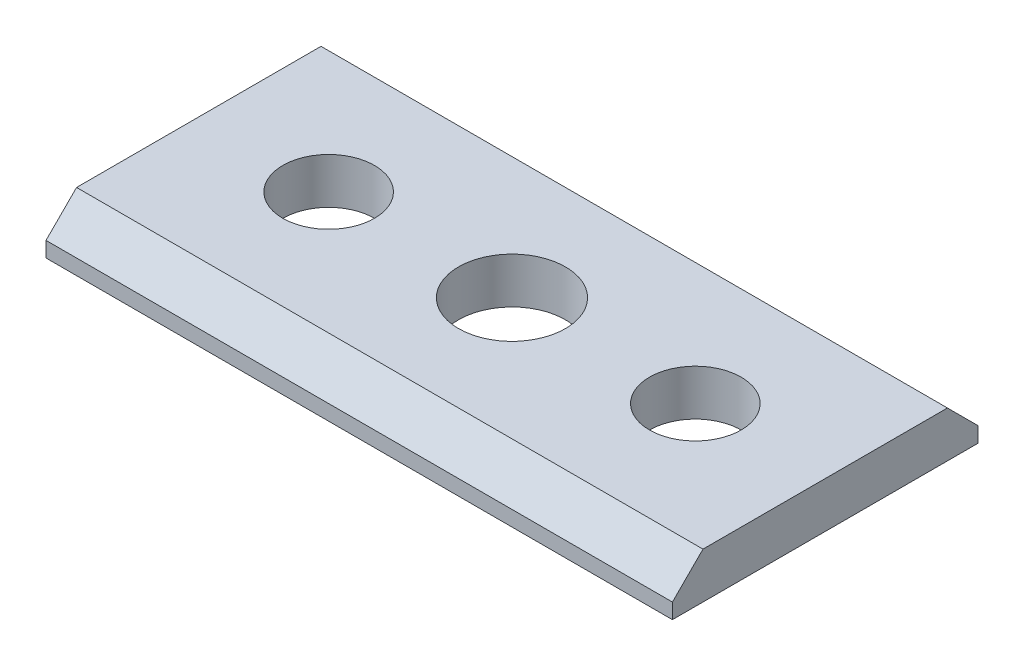
ISO-10303-21;
HEADER;
FILE_DESCRIPTION(('STEP AP214'),'2;1');
FILE_NAME('part.step','',(''),(''),'','','');
FILE_SCHEMA(('AUTOMOTIVE_DESIGN { 1 0 10303 214 1 1 1 1 }'));
ENDSEC;
DATA;
#1=APPLICATION_CONTEXT('core data for automotive mechanical design processes');
#2=APPLICATION_PROTOCOL_DEFINITION('international standard','automotive_design',2000,#1);
#3=PRODUCT_CONTEXT('',#1,'mechanical');
#4=PRODUCT('Part','Part','',(#3));
#5=PRODUCT_RELATED_PRODUCT_CATEGORY('part','',(#4));
#6=PRODUCT_DEFINITION_FORMATION('','',#4);
#7=PRODUCT_DEFINITION_CONTEXT('part definition',#1,'design');
#8=PRODUCT_DEFINITION('design','',#6,#7);
#9=PRODUCT_DEFINITION_SHAPE('','',#8);
#10=(LENGTH_UNIT() NAMED_UNIT(*) SI_UNIT(.MILLI.,.METRE.));
#11=(NAMED_UNIT(*) PLANE_ANGLE_UNIT() SI_UNIT($,.RADIAN.));
#12=(NAMED_UNIT(*) SI_UNIT($,.STERADIAN.) SOLID_ANGLE_UNIT());
#13=UNCERTAINTY_MEASURE_WITH_UNIT(LENGTH_MEASURE(1.E-05),#10,'distance_accuracy_value','');
#14=(GEOMETRIC_REPRESENTATION_CONTEXT(3) GLOBAL_UNCERTAINTY_ASSIGNED_CONTEXT((#13)) GLOBAL_UNIT_ASSIGNED_CONTEXT((#10,
#11,#12)) REPRESENTATION_CONTEXT('',''));
#15=CARTESIAN_POINT('',(0.,0.,0.));
#16=DIRECTION('',(0.,0.,1.));
#17=DIRECTION('',(1.,0.,0.));
#18=AXIS2_PLACEMENT_3D('',#15,#16,#17);
#19=CARTESIAN_POINT('',(41.,-3.,-20.));
#20=DIRECTION('',(0.,0.,-1.));
#21=DIRECTION('',(-1.,0.,0.));
#22=AXIS2_PLACEMENT_3D('',#19,#20,#21);
#23=PLANE('',#22);
#24=DIRECTION('',(0.,1.,0.));
#25=VECTOR('',#24,1.);
#26=CARTESIAN_POINT('',(0.,-3.,-20.));
#27=LINE('',#26,#25);
#28=CARTESIAN_POINT('',(0.,-3.,-20.));
#29=VERTEX_POINT('',#28);
#30=CARTESIAN_POINT('',(0.,-2.00000000000001,-20.));
#31=VERTEX_POINT('',#30);
#32=EDGE_CURVE('E84',#29,#31,#27,.T.);
#33=ORIENTED_EDGE('',*,*,#32,.T.);
#34=DIRECTION('',(1.,0.,0.));
#35=VECTOR('',#34,1.);
#36=CARTESIAN_POINT('',(41.,-2.00000000000001,-20.));
#37=LINE('',#36,#35);
#38=CARTESIAN_POINT('',(41.,-2.00000000000001,-20.));
#39=VERTEX_POINT('',#38);
#40=EDGE_CURVE('E55',#31,#39,#37,.T.);
#41=ORIENTED_EDGE('',*,*,#40,.T.);
#42=DIRECTION('',(0.,1.,0.));
#43=VECTOR('',#42,1.);
#44=CARTESIAN_POINT('',(41.,-3.,-20.));
#45=LINE('',#44,#43);
#46=CARTESIAN_POINT('',(41.,-3.,-20.));
#47=VERTEX_POINT('',#46);
#48=EDGE_CURVE('E105',#47,#39,#45,.T.);
#49=ORIENTED_EDGE('',*,*,#48,.F.);
#50=DIRECTION('',(-1.,0.,0.));
#51=VECTOR('',#50,1.);
#52=CARTESIAN_POINT('',(41.,-3.,-20.));
#53=LINE('',#52,#51);
#54=EDGE_CURVE('E100',#47,#29,#53,.T.);
#55=ORIENTED_EDGE('',*,*,#54,.T.);
#56=EDGE_LOOP('',(#33,#41,#49,#55));
#57=FACE_BOUND('',#56,.T.);
#58=ADVANCED_FACE('F32',(#57),#23,.T.);
#59=CARTESIAN_POINT('',(41.,-3.,0.));
#60=DIRECTION('',(1.,0.,0.));
#61=DIRECTION('',(0.,0.,-1.));
#62=AXIS2_PLACEMENT_3D('',#59,#60,#61);
#63=PLANE('',#62);
#64=ORIENTED_EDGE('',*,*,#48,.T.);
#65=DIRECTION('',(0.,-0.707106781186549,-0.707106781186546));
#66=VECTOR('',#65,1.);
#67=CARTESIAN_POINT('',(41.,7.5,-10.5));
#68=LINE('',#67,#66);
#69=CARTESIAN_POINT('',(41.,0.,-18.));
#70=VERTEX_POINT('',#69);
#71=EDGE_CURVE('E40',#39,#70,#68,.F.);
#72=ORIENTED_EDGE('',*,*,#71,.T.);
#73=DIRECTION('',(0.,0.,-1.));
#74=VECTOR('',#73,1.);
#75=CARTESIAN_POINT('',(41.,0.,0.));
#76=LINE('',#75,#74);
#77=CARTESIAN_POINT('',(41.,0.,-2.));
#78=VERTEX_POINT('',#77);
#79=EDGE_CURVE('E106',#78,#70,#76,.T.);
#80=ORIENTED_EDGE('',*,*,#79,.F.);
#81=DIRECTION('',(0.,0.707106781186549,-0.707106781186546));
#82=VECTOR('',#81,1.);
#83=CARTESIAN_POINT('',(41.,-2.50000000000001,0.499999999999996));
#84=LINE('',#83,#82);
#85=CARTESIAN_POINT('',(41.,-2.00000000000001,0.));
#86=VERTEX_POINT('',#85);
#87=EDGE_CURVE('E47',#78,#86,#84,.F.);
#88=ORIENTED_EDGE('',*,*,#87,.T.);
#89=DIRECTION('',(0.,1.,0.));
#90=VECTOR('',#89,1.);
#91=CARTESIAN_POINT('',(41.,-3.,0.));
#92=LINE('',#91,#90);
#93=CARTESIAN_POINT('',(41.,-3.,0.));
#94=VERTEX_POINT('',#93);
#95=EDGE_CURVE('E122',#94,#86,#92,.T.);
#96=ORIENTED_EDGE('',*,*,#95,.F.);
#97=DIRECTION('',(0.,0.,-1.));
#98=VECTOR('',#97,1.);
#99=CARTESIAN_POINT('',(41.,-3.,0.));
#100=LINE('',#99,#98);
#101=EDGE_CURVE('E93',#94,#47,#100,.T.);
#102=ORIENTED_EDGE('',*,*,#101,.T.);
#103=EDGE_LOOP('',(#64,#72,#80,#88,#96,#102));
#104=FACE_BOUND('',#103,.T.);
#105=ADVANCED_FACE('F135',(#104),#63,.T.);
#106=CARTESIAN_POINT('',(0.,-3.,0.));
#107=DIRECTION('',(0.,0.,1.));
#108=DIRECTION('',(1.,0.,0.));
#109=AXIS2_PLACEMENT_3D('',#106,#107,#108);
#110=PLANE('',#109);
#111=ORIENTED_EDGE('',*,*,#95,.T.);
#112=DIRECTION('',(-1.,0.,0.));
#113=VECTOR('',#112,1.);
#114=CARTESIAN_POINT('',(0.,-2.00000000000001,0.));
#115=LINE('',#114,#113);
#116=CARTESIAN_POINT('',(0.,-2.00000000000001,0.));
#117=VERTEX_POINT('',#116);
#118=EDGE_CURVE('E11',#86,#117,#115,.T.);
#119=ORIENTED_EDGE('',*,*,#118,.T.);
#120=DIRECTION('',(0.,1.,0.));
#121=VECTOR('',#120,1.);
#122=CARTESIAN_POINT('',(0.,-3.,0.));
#123=LINE('',#122,#121);
#124=CARTESIAN_POINT('',(0.,-3.,0.));
#125=VERTEX_POINT('',#124);
#126=EDGE_CURVE('E92',#125,#117,#123,.T.);
#127=ORIENTED_EDGE('',*,*,#126,.F.);
#128=DIRECTION('',(1.,0.,0.));
#129=VECTOR('',#128,1.);
#130=CARTESIAN_POINT('',(0.,-3.,0.));
#131=LINE('',#130,#129);
#132=EDGE_CURVE('E103',#125,#94,#131,.T.);
#133=ORIENTED_EDGE('',*,*,#132,.T.);
#134=EDGE_LOOP('',(#111,#119,#127,#133));
#135=FACE_BOUND('',#134,.T.);
#136=ADVANCED_FACE('F157',(#135),#110,.T.);
#137=CARTESIAN_POINT('',(0.,-3.,-20.));
#138=DIRECTION('',(-1.,0.,0.));
#139=DIRECTION('',(0.,0.,1.));
#140=AXIS2_PLACEMENT_3D('',#137,#138,#139);
#141=PLANE('',#140);
#142=DIRECTION('',(0.,0.,1.));
#143=VECTOR('',#142,1.);
#144=CARTESIAN_POINT('',(0.,0.,-20.));
#145=LINE('',#144,#143);
#146=CARTESIAN_POINT('',(0.,0.,-18.));
#147=VERTEX_POINT('',#146);
#148=CARTESIAN_POINT('',(0.,0.,-2.));
#149=VERTEX_POINT('',#148);
#150=EDGE_CURVE('E109',#147,#149,#145,.T.);
#151=ORIENTED_EDGE('',*,*,#150,.F.);
#152=DIRECTION('',(0.,0.707106781186549,0.707106781186546));
#153=VECTOR('',#152,1.);
#154=CARTESIAN_POINT('',(0.,-2.50000000000001,-20.5));
#155=LINE('',#154,#153);
#156=EDGE_CURVE('E90',#147,#31,#155,.F.);
#157=ORIENTED_EDGE('',*,*,#156,.T.);
#158=ORIENTED_EDGE('',*,*,#32,.F.);
#159=DIRECTION('',(0.,0.,1.));
#160=VECTOR('',#159,1.);
#161=CARTESIAN_POINT('',(0.,-3.,-20.));
#162=LINE('',#161,#160);
#163=EDGE_CURVE('E89',#29,#125,#162,.T.);
#164=ORIENTED_EDGE('',*,*,#163,.T.);
#165=ORIENTED_EDGE('',*,*,#126,.T.);
#166=DIRECTION('',(0.,-0.707106781186549,0.707106781186546));
#167=VECTOR('',#166,1.);
#168=CARTESIAN_POINT('',(0.,7.49999999999999,-9.49999999999996));
#169=LINE('',#168,#167);
#170=EDGE_CURVE('E130',#117,#149,#169,.F.);
#171=ORIENTED_EDGE('',*,*,#170,.T.);
#172=EDGE_LOOP('',(#151,#157,#158,#164,#165,#171));
#173=FACE_BOUND('',#172,.T.);
#174=ADVANCED_FACE('F87',(#173),#141,.T.);
#175=CARTESIAN_POINT('',(0.,-3.,0.));
#176=DIRECTION('',(0.,1.,0.));
#177=DIRECTION('',(0.,0.,1.));
#178=AXIS2_PLACEMENT_3D('',#175,#176,#177);
#179=PLANE('',#178);
#180=CARTESIAN_POINT('',(20.5,-3.,-10.));
#181=DIRECTION('',(0.,1.,0.));
#182=DIRECTION('',(0.,0.,1.));
#183=AXIS2_PLACEMENT_3D('',#180,#181,#182);
#184=CIRCLE('',#183,3.5);
#185=CARTESIAN_POINT('',(20.5,-3.,-6.5));
#186=VERTEX_POINT('',#185);
#187=EDGE_CURVE('E187',#186,#186,#184,.T.);
#188=ORIENTED_EDGE('',*,*,#187,.T.);
#189=EDGE_LOOP('',(#188));
#190=FACE_BOUND('',#189,.T.);
#191=CARTESIAN_POINT('',(32.5,-3.,-10.));
#192=DIRECTION('',(0.,1.,0.));
#193=DIRECTION('',(0.,0.,1.));
#194=AXIS2_PLACEMENT_3D('',#191,#192,#193);
#195=CIRCLE('',#194,3.);
#196=CARTESIAN_POINT('',(32.5,-3.,-7.));
#197=VERTEX_POINT('',#196);
#198=EDGE_CURVE('E182',#197,#197,#195,.T.);
#199=ORIENTED_EDGE('',*,*,#198,.T.);
#200=EDGE_LOOP('',(#199));
#201=FACE_BOUND('',#200,.T.);
#202=CARTESIAN_POINT('',(8.50000000000001,-3.,-10.));
#203=DIRECTION('',(0.,1.,0.));
#204=DIRECTION('',(0.,0.,1.));
#205=AXIS2_PLACEMENT_3D('',#202,#203,#204);
#206=CIRCLE('',#205,3.);
#207=CARTESIAN_POINT('',(8.50000000000001,-3.,-7.));
#208=VERTEX_POINT('',#207);
#209=EDGE_CURVE('E118',#208,#208,#206,.T.);
#210=ORIENTED_EDGE('',*,*,#209,.T.);
#211=EDGE_LOOP('',(#210));
#212=FACE_BOUND('',#211,.T.);
#213=ORIENTED_EDGE('',*,*,#54,.F.);
#214=ORIENTED_EDGE('',*,*,#101,.F.);
#215=ORIENTED_EDGE('',*,*,#132,.F.);
#216=ORIENTED_EDGE('',*,*,#163,.F.);
#217=EDGE_LOOP('',(#213,#214,#215,#216));
#218=FACE_BOUND('',#217,.T.);
#219=ADVANCED_FACE('F98',(#190,#201,#212,#218),#179,.F.);
#220=CARTESIAN_POINT('',(0.,0.,0.));
#221=DIRECTION('',(0.,1.,0.));
#222=DIRECTION('',(0.,0.,1.));
#223=AXIS2_PLACEMENT_3D('',#220,#221,#222);
#224=PLANE('',#223);
#225=CARTESIAN_POINT('',(20.5,0.,-10.));
#226=DIRECTION('',(0.,1.,0.));
#227=DIRECTION('',(0.,0.,1.));
#228=AXIS2_PLACEMENT_3D('',#225,#226,#227);
#229=CIRCLE('',#228,3.5);
#230=CARTESIAN_POINT('',(20.5,0.,-6.5));
#231=VERTEX_POINT('',#230);
#232=EDGE_CURVE('E191',#231,#231,#229,.T.);
#233=ORIENTED_EDGE('',*,*,#232,.F.);
#234=EDGE_LOOP('',(#233));
#235=FACE_BOUND('',#234,.T.);
#236=CARTESIAN_POINT('',(32.5,0.,-10.));
#237=DIRECTION('',(0.,1.,0.));
#238=DIRECTION('',(0.,0.,1.));
#239=AXIS2_PLACEMENT_3D('',#236,#237,#238);
#240=CIRCLE('',#239,3.);
#241=CARTESIAN_POINT('',(32.5,0.,-7.));
#242=VERTEX_POINT('',#241);
#243=EDGE_CURVE('E185',#242,#242,#240,.T.);
#244=ORIENTED_EDGE('',*,*,#243,.F.);
#245=EDGE_LOOP('',(#244));
#246=FACE_BOUND('',#245,.T.);
#247=CARTESIAN_POINT('',(8.50000000000001,0.,-10.));
#248=DIRECTION('',(0.,1.,0.));
#249=DIRECTION('',(0.,0.,1.));
#250=AXIS2_PLACEMENT_3D('',#247,#248,#249);
#251=CIRCLE('',#250,3.);
#252=CARTESIAN_POINT('',(8.50000000000001,0.,-7.));
#253=VERTEX_POINT('',#252);
#254=EDGE_CURVE('E112',#253,#253,#251,.T.);
#255=ORIENTED_EDGE('',*,*,#254,.F.);
#256=EDGE_LOOP('',(#255));
#257=FACE_BOUND('',#256,.T.);
#258=ORIENTED_EDGE('',*,*,#79,.T.);
#259=DIRECTION('',(-1.,0.,0.));
#260=VECTOR('',#259,1.);
#261=CARTESIAN_POINT('',(0.,0.,-18.));
#262=LINE('',#261,#260);
#263=EDGE_CURVE('E127',#70,#147,#262,.T.);
#264=ORIENTED_EDGE('',*,*,#263,.T.);
#265=ORIENTED_EDGE('',*,*,#150,.T.);
#266=DIRECTION('',(1.,0.,0.));
#267=VECTOR('',#266,1.);
#268=CARTESIAN_POINT('',(0.,0.,-2.));
#269=LINE('',#268,#267);
#270=EDGE_CURVE('E121',#149,#78,#269,.T.);
#271=ORIENTED_EDGE('',*,*,#270,.T.);
#272=EDGE_LOOP('',(#258,#264,#265,#271));
#273=FACE_BOUND('',#272,.T.);
#274=ADVANCED_FACE('F139',(#235,#246,#257,#273),#224,.T.);
#275=CARTESIAN_POINT('',(8.50000000000001,-3.,-10.));
#276=DIRECTION('',(0.,1.,0.));
#277=DIRECTION('',(0.,0.,1.));
#278=AXIS2_PLACEMENT_3D('',#275,#276,#277);
#279=CYLINDRICAL_SURFACE('',#278,3.);
#280=ORIENTED_EDGE('',*,*,#209,.F.);
#281=EDGE_LOOP('',(#280));
#282=FACE_BOUND('',#281,.T.);
#283=ORIENTED_EDGE('',*,*,#254,.T.);
#284=EDGE_LOOP('',(#283));
#285=FACE_BOUND('',#284,.T.);
#286=ADVANCED_FACE('F167',(#282,#285),#279,.F.);
#287=CARTESIAN_POINT('',(32.5,-3.,-10.));
#288=DIRECTION('',(0.,1.,0.));
#289=DIRECTION('',(0.,0.,1.));
#290=AXIS2_PLACEMENT_3D('',#287,#288,#289);
#291=CYLINDRICAL_SURFACE('',#290,3.);
#292=ORIENTED_EDGE('',*,*,#198,.F.);
#293=EDGE_LOOP('',(#292));
#294=FACE_BOUND('',#293,.T.);
#295=ORIENTED_EDGE('',*,*,#243,.T.);
#296=EDGE_LOOP('',(#295));
#297=FACE_BOUND('',#296,.T.);
#298=ADVANCED_FACE('F149',(#294,#297),#291,.F.);
#299=CARTESIAN_POINT('',(20.5,-3.,-10.));
#300=DIRECTION('',(0.,1.,0.));
#301=DIRECTION('',(0.,0.,1.));
#302=AXIS2_PLACEMENT_3D('',#299,#300,#301);
#303=CYLINDRICAL_SURFACE('',#302,3.5);
#304=ORIENTED_EDGE('',*,*,#187,.F.);
#305=EDGE_LOOP('',(#304));
#306=FACE_BOUND('',#305,.T.);
#307=ORIENTED_EDGE('',*,*,#232,.T.);
#308=EDGE_LOOP('',(#307));
#309=FACE_BOUND('',#308,.T.);
#310=ADVANCED_FACE('F143',(#306,#309),#303,.F.);
#311=CARTESIAN_POINT('',(0.,0.,-18.));
#312=DIRECTION('',(0.,-0.707106781186546,0.707106781186549));
#313=DIRECTION('',(-1.,0.,0.));
#314=AXIS2_PLACEMENT_3D('',#311,#312,#313);
#315=PLANE('',#314);
#316=ORIENTED_EDGE('',*,*,#71,.F.);
#317=ORIENTED_EDGE('',*,*,#40,.F.);
#318=ORIENTED_EDGE('',*,*,#156,.F.);
#319=ORIENTED_EDGE('',*,*,#263,.F.);
#320=EDGE_LOOP('',(#316,#317,#318,#319));
#321=FACE_BOUND('',#320,.T.);
#322=ADVANCED_FACE('F141',(#321),#315,.F.);
#323=CARTESIAN_POINT('',(0.,0.,-2.));
#324=DIRECTION('',(0.,-0.707106781186546,-0.707106781186549));
#325=DIRECTION('',(1.,0.,0.));
#326=AXIS2_PLACEMENT_3D('',#323,#324,#325);
#327=PLANE('',#326);
#328=ORIENTED_EDGE('',*,*,#170,.F.);
#329=ORIENTED_EDGE('',*,*,#118,.F.);
#330=ORIENTED_EDGE('',*,*,#87,.F.);
#331=ORIENTED_EDGE('',*,*,#270,.F.);
#332=EDGE_LOOP('',(#328,#329,#330,#331));
#333=FACE_BOUND('',#332,.T.);
#334=ADVANCED_FACE('F34',(#333),#327,.F.);
#335=CLOSED_SHELL('',(#58,#105,#136,#174,#219,#274,#286,#298,#310,#322,#334));
#336=MANIFOLD_SOLID_BREP('B2',#335);
#337=ADVANCED_BREP_SHAPE_REPRESENTATION('',(#18,#336),#14);
#338=SHAPE_DEFINITION_REPRESENTATION(#9,#337);
ENDSEC;
END-ISO-10303-21;
